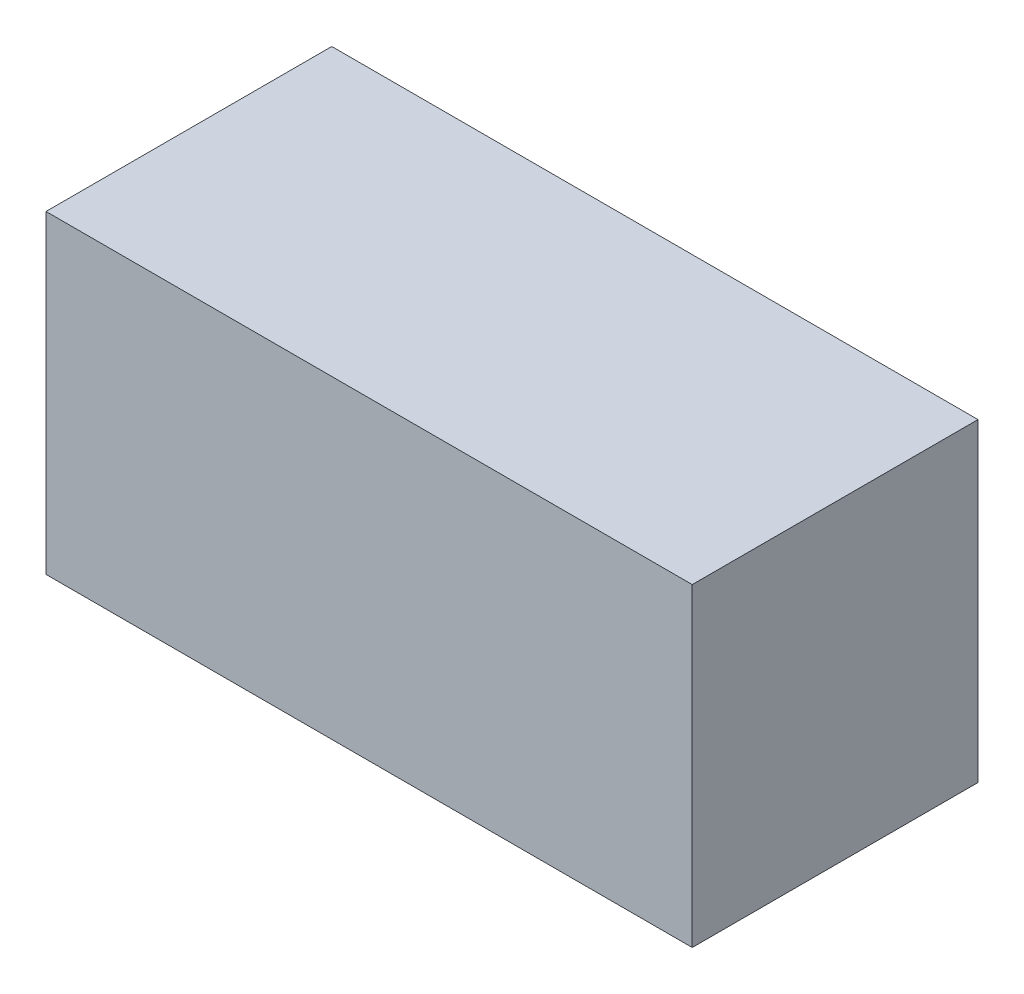
ISO-10303-21;
HEADER;
FILE_DESCRIPTION(('STEP AP214'),'2;1');
FILE_NAME('part.step','',(''),(''),'','','');
FILE_SCHEMA(('AUTOMOTIVE_DESIGN { 1 0 10303 214 1 1 1 1 }'));
ENDSEC;
DATA;
#1=APPLICATION_CONTEXT('core data for automotive mechanical design processes');
#2=APPLICATION_PROTOCOL_DEFINITION('international standard','automotive_design',2000,#1);
#3=PRODUCT_CONTEXT('',#1,'mechanical');
#4=PRODUCT('Part','Part','',(#3));
#5=PRODUCT_RELATED_PRODUCT_CATEGORY('part','',(#4));
#6=PRODUCT_DEFINITION_FORMATION('','',#4);
#7=PRODUCT_DEFINITION_CONTEXT('part definition',#1,'design');
#8=PRODUCT_DEFINITION('design','',#6,#7);
#9=PRODUCT_DEFINITION_SHAPE('','',#8);
#10=(LENGTH_UNIT() NAMED_UNIT(*) SI_UNIT(.MILLI.,.METRE.));
#11=(NAMED_UNIT(*) PLANE_ANGLE_UNIT() SI_UNIT($,.RADIAN.));
#12=(NAMED_UNIT(*) SI_UNIT($,.STERADIAN.) SOLID_ANGLE_UNIT());
#13=UNCERTAINTY_MEASURE_WITH_UNIT(LENGTH_MEASURE(1.E-05),#10,'distance_accuracy_value','');
#14=(GEOMETRIC_REPRESENTATION_CONTEXT(3) GLOBAL_UNCERTAINTY_ASSIGNED_CONTEXT((#13)) GLOBAL_UNIT_ASSIGNED_CONTEXT((#10,
#11,#12)) REPRESENTATION_CONTEXT('',''));
#15=CARTESIAN_POINT('',(0.,0.,0.));
#16=DIRECTION('',(0.,0.,1.));
#17=DIRECTION('',(1.,0.,0.));
#18=AXIS2_PLACEMENT_3D('',#15,#16,#17);
#19=CARTESIAN_POINT('',(280.416,136.398,124.0028));
#20=DIRECTION('',(-1.,0.,0.));
#21=DIRECTION('',(0.,0.,1.));
#22=AXIS2_PLACEMENT_3D('',#19,#20,#21);
#23=PLANE('',#22);
#24=DIRECTION('',(0.,0.,-1.));
#25=VECTOR('',#24,1.);
#26=CARTESIAN_POINT('',(280.416,-136.398,124.0028));
#27=LINE('',#26,#25);
#28=CARTESIAN_POINT('',(280.416,-136.398,124.0028));
#29=VERTEX_POINT('',#28);
#30=CARTESIAN_POINT('',(280.416,-136.398,-124.0028));
#31=VERTEX_POINT('',#30);
#32=EDGE_CURVE('E95',#29,#31,#27,.T.);
#33=ORIENTED_EDGE('',*,*,#32,.T.);
#34=DIRECTION('',(0.,-1.,0.));
#35=VECTOR('',#34,1.);
#36=CARTESIAN_POINT('',(280.416,136.398,-124.0028));
#37=LINE('',#36,#35);
#38=CARTESIAN_POINT('',(280.416,136.398,-124.0028));
#39=VERTEX_POINT('',#38);
#40=EDGE_CURVE('E11',#39,#31,#37,.T.);
#41=ORIENTED_EDGE('',*,*,#40,.F.);
#42=DIRECTION('',(0.,0.,-1.));
#43=VECTOR('',#42,1.);
#44=CARTESIAN_POINT('',(280.416,136.398,124.0028));
#45=LINE('',#44,#43);
#46=CARTESIAN_POINT('',(280.416,136.398,124.0028));
#47=VERTEX_POINT('',#46);
#48=EDGE_CURVE('E83',#47,#39,#45,.T.);
#49=ORIENTED_EDGE('',*,*,#48,.F.);
#50=DIRECTION('',(0.,-1.,0.));
#51=VECTOR('',#50,1.);
#52=CARTESIAN_POINT('',(280.416,136.398,124.0028));
#53=LINE('',#52,#51);
#54=EDGE_CURVE('E91',#47,#29,#53,.T.);
#55=ORIENTED_EDGE('',*,*,#54,.T.);
#56=EDGE_LOOP('',(#33,#41,#49,#55));
#57=FACE_BOUND('',#56,.T.);
#58=ADVANCED_FACE('F32',(#57),#23,.F.);
#59=CARTESIAN_POINT('',(-280.416,136.398,-124.0028));
#60=DIRECTION('',(0.,0.,1.));
#61=DIRECTION('',(1.,0.,0.));
#62=AXIS2_PLACEMENT_3D('',#59,#60,#61);
#63=PLANE('',#62);
#64=DIRECTION('',(-1.,0.,0.));
#65=VECTOR('',#64,1.);
#66=CARTESIAN_POINT('',(-280.416,-136.398,-124.0028));
#67=LINE('',#66,#65);
#68=CARTESIAN_POINT('',(-280.416,-136.398,-124.0028));
#69=VERTEX_POINT('',#68);
#70=EDGE_CURVE('E87',#31,#69,#67,.T.);
#71=ORIENTED_EDGE('',*,*,#70,.T.);
#72=DIRECTION('',(0.,-1.,0.));
#73=VECTOR('',#72,1.);
#74=CARTESIAN_POINT('',(-280.416,136.398,-124.0028));
#75=LINE('',#74,#73);
#76=CARTESIAN_POINT('',(-280.416,136.398,-124.0028));
#77=VERTEX_POINT('',#76);
#78=EDGE_CURVE('E40',#77,#69,#75,.T.);
#79=ORIENTED_EDGE('',*,*,#78,.F.);
#80=DIRECTION('',(-1.,0.,0.));
#81=VECTOR('',#80,1.);
#82=CARTESIAN_POINT('',(-280.416,136.398,-124.0028));
#83=LINE('',#82,#81);
#84=EDGE_CURVE('E78',#39,#77,#83,.T.);
#85=ORIENTED_EDGE('',*,*,#84,.F.);
#86=ORIENTED_EDGE('',*,*,#40,.T.);
#87=EDGE_LOOP('',(#71,#79,#85,#86));
#88=FACE_BOUND('',#87,.T.);
#89=ADVANCED_FACE('F86',(#88),#63,.F.);
#90=CARTESIAN_POINT('',(-280.416,136.398,124.0028));
#91=DIRECTION('',(1.,0.,0.));
#92=DIRECTION('',(0.,0.,-1.));
#93=AXIS2_PLACEMENT_3D('',#90,#91,#92);
#94=PLANE('',#93);
#95=DIRECTION('',(0.,0.,1.));
#96=VECTOR('',#95,1.);
#97=CARTESIAN_POINT('',(-280.416,-136.398,124.0028));
#98=LINE('',#97,#96);
#99=CARTESIAN_POINT('',(-280.416,-136.398,124.0028));
#100=VERTEX_POINT('',#99);
#101=EDGE_CURVE('E65',#69,#100,#98,.T.);
#102=ORIENTED_EDGE('',*,*,#101,.T.);
#103=DIRECTION('',(0.,-1.,0.));
#104=VECTOR('',#103,1.);
#105=CARTESIAN_POINT('',(-280.416,136.398,124.0028));
#106=LINE('',#105,#104);
#107=CARTESIAN_POINT('',(-280.416,136.398,124.0028));
#108=VERTEX_POINT('',#107);
#109=EDGE_CURVE('E88',#108,#100,#106,.T.);
#110=ORIENTED_EDGE('',*,*,#109,.F.);
#111=DIRECTION('',(0.,0.,1.));
#112=VECTOR('',#111,1.);
#113=CARTESIAN_POINT('',(-280.416,136.398,124.0028));
#114=LINE('',#113,#112);
#115=EDGE_CURVE('E81',#77,#108,#114,.T.);
#116=ORIENTED_EDGE('',*,*,#115,.F.);
#117=ORIENTED_EDGE('',*,*,#78,.T.);
#118=EDGE_LOOP('',(#102,#110,#116,#117));
#119=FACE_BOUND('',#118,.T.);
#120=ADVANCED_FACE('F89',(#119),#94,.F.);
#121=CARTESIAN_POINT('',(-280.416,136.398,124.0028));
#122=DIRECTION('',(0.,0.,-1.));
#123=DIRECTION('',(-1.,0.,0.));
#124=AXIS2_PLACEMENT_3D('',#121,#122,#123);
#125=PLANE('',#124);
#126=DIRECTION('',(1.,0.,0.));
#127=VECTOR('',#126,1.);
#128=CARTESIAN_POINT('',(-280.416,-136.398,124.0028));
#129=LINE('',#128,#127);
#130=EDGE_CURVE('E71',#100,#29,#129,.T.);
#131=ORIENTED_EDGE('',*,*,#130,.T.);
#132=ORIENTED_EDGE('',*,*,#54,.F.);
#133=DIRECTION('',(1.,0.,0.));
#134=VECTOR('',#133,1.);
#135=CARTESIAN_POINT('',(-280.416,136.398,124.0028));
#136=LINE('',#135,#134);
#137=EDGE_CURVE('E48',#108,#47,#136,.T.);
#138=ORIENTED_EDGE('',*,*,#137,.F.);
#139=ORIENTED_EDGE('',*,*,#109,.T.);
#140=EDGE_LOOP('',(#131,#132,#138,#139));
#141=FACE_BOUND('',#140,.T.);
#142=ADVANCED_FACE('F102',(#141),#125,.F.);
#143=CARTESIAN_POINT('',(280.416,136.398,-124.0028));
#144=DIRECTION('',(0.,-1.,0.));
#145=DIRECTION('',(0.,0.,-1.));
#146=AXIS2_PLACEMENT_3D('',#143,#144,#145);
#147=PLANE('',#146);
#148=ORIENTED_EDGE('',*,*,#48,.T.);
#149=ORIENTED_EDGE('',*,*,#84,.T.);
#150=ORIENTED_EDGE('',*,*,#115,.T.);
#151=ORIENTED_EDGE('',*,*,#137,.T.);
#152=EDGE_LOOP('',(#148,#149,#150,#151));
#153=FACE_BOUND('',#152,.T.);
#154=ADVANCED_FACE('F79',(#153),#147,.F.);
#155=CARTESIAN_POINT('',(280.416,-136.398,-124.0028));
#156=DIRECTION('',(0.,-1.,0.));
#157=DIRECTION('',(0.,0.,-1.));
#158=AXIS2_PLACEMENT_3D('',#155,#156,#157);
#159=PLANE('',#158);
#160=ORIENTED_EDGE('',*,*,#32,.F.);
#161=ORIENTED_EDGE('',*,*,#130,.F.);
#162=ORIENTED_EDGE('',*,*,#101,.F.);
#163=ORIENTED_EDGE('',*,*,#70,.F.);
#164=EDGE_LOOP('',(#160,#161,#162,#163));
#165=FACE_BOUND('',#164,.T.);
#166=ADVANCED_FACE('F105',(#165),#159,.T.);
#167=CLOSED_SHELL('',(#58,#89,#120,#142,#154,#166));
#168=MANIFOLD_SOLID_BREP('B2',#167);
#169=ADVANCED_BREP_SHAPE_REPRESENTATION('',(#18,#168),#14);
#170=SHAPE_DEFINITION_REPRESENTATION(#9,#169);
ENDSEC;
END-ISO-10303-21;
